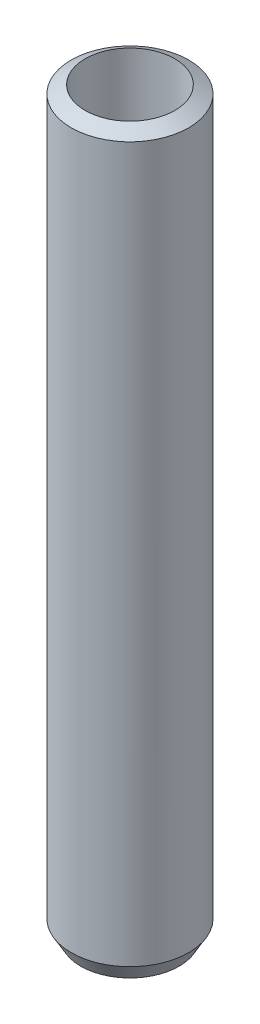
ISO-10303-21;
HEADER;
FILE_DESCRIPTION(('STEP AP214'),'2;1');
FILE_NAME('part.step','',(''),(''),'','','');
FILE_SCHEMA(('AUTOMOTIVE_DESIGN { 1 0 10303 214 1 1 1 1 }'));
ENDSEC;
DATA;
#1=APPLICATION_CONTEXT('core data for automotive mechanical design processes');
#2=APPLICATION_PROTOCOL_DEFINITION('international standard','automotive_design',2000,#1);
#3=PRODUCT_CONTEXT('',#1,'mechanical');
#4=PRODUCT('Part','Part','',(#3));
#5=PRODUCT_RELATED_PRODUCT_CATEGORY('part','',(#4));
#6=PRODUCT_DEFINITION_FORMATION('','',#4);
#7=PRODUCT_DEFINITION_CONTEXT('part definition',#1,'design');
#8=PRODUCT_DEFINITION('design','',#6,#7);
#9=PRODUCT_DEFINITION_SHAPE('','',#8);
#10=(LENGTH_UNIT() NAMED_UNIT(*) SI_UNIT(.MILLI.,.METRE.));
#11=(NAMED_UNIT(*) PLANE_ANGLE_UNIT() SI_UNIT($,.RADIAN.));
#12=(NAMED_UNIT(*) SI_UNIT($,.STERADIAN.) SOLID_ANGLE_UNIT());
#13=UNCERTAINTY_MEASURE_WITH_UNIT(LENGTH_MEASURE(1.E-05),#10,'distance_accuracy_value','');
#14=(GEOMETRIC_REPRESENTATION_CONTEXT(3) GLOBAL_UNCERTAINTY_ASSIGNED_CONTEXT((#13)) GLOBAL_UNIT_ASSIGNED_CONTEXT((#10,
#11,#12)) REPRESENTATION_CONTEXT('',''));
#15=CARTESIAN_POINT('',(0.,0.,0.));
#16=DIRECTION('',(0.,0.,1.));
#17=DIRECTION('',(1.,0.,0.));
#18=AXIS2_PLACEMENT_3D('',#15,#16,#17);
#19=CARTESIAN_POINT('',(0.,315.095017230182,0.));
#20=DIRECTION('',(0.,-1.,0.));
#21=DIRECTION('',(0.,0.,-1.));
#22=AXIS2_PLACEMENT_3D('',#19,#20,#21);
#23=CYLINDRICAL_SURFACE('',#22,25.);
#24=CARTESIAN_POINT('',(0.,311.028406974981,0.));
#25=DIRECTION('',(0.,1.,0.));
#26=DIRECTION('',(0.,0.,1.));
#27=AXIS2_PLACEMENT_3D('',#24,#25,#26);
#28=CIRCLE('',#27,25.);
#29=CARTESIAN_POINT('',(0.,311.028406974981,25.));
#30=VERTEX_POINT('',#29);
#31=EDGE_CURVE('E50',#30,#30,#28,.F.);
#32=ORIENTED_EDGE('',*,*,#31,.T.);
#33=EDGE_LOOP('',(#32));
#34=FACE_BOUND('',#33,.T.);
#35=CARTESIAN_POINT('',(0.,7.04357557658775,0.));
#36=DIRECTION('',(0.,1.,0.));
#37=DIRECTION('',(0.,0.,1.));
#38=AXIS2_PLACEMENT_3D('',#35,#36,#37);
#39=CIRCLE('',#38,25.);
#40=CARTESIAN_POINT('',(0.,7.04357557658775,25.));
#41=VERTEX_POINT('',#40);
#42=EDGE_CURVE('E51',#41,#41,#39,.T.);
#43=ORIENTED_EDGE('',*,*,#42,.T.);
#44=EDGE_LOOP('',(#43));
#45=FACE_BOUND('',#44,.T.);
#46=ADVANCED_FACE('F39',(#34,#45),#23,.T.);
#47=CARTESIAN_POINT('',(0.,0.,0.));
#48=DIRECTION('',(0.,1.,0.));
#49=DIRECTION('',(0.,0.,1.));
#50=AXIS2_PLACEMENT_3D('',#47,#48,#49);
#51=PLANE('',#50);
#52=CARTESIAN_POINT('',(0.,0.,0.));
#53=DIRECTION('',(0.,1.,0.));
#54=DIRECTION('',(0.,0.,1.));
#55=AXIS2_PLACEMENT_3D('',#52,#53,#54);
#56=CIRCLE('',#55,20.9333897447996);
#57=CARTESIAN_POINT('',(0.,0.,20.9333897447996));
#58=VERTEX_POINT('',#57);
#59=EDGE_CURVE('E10',#58,#58,#56,.F.);
#60=ORIENTED_EDGE('',*,*,#59,.T.);
#61=EDGE_LOOP('',(#60));
#62=FACE_BOUND('',#61,.T.);
#63=CARTESIAN_POINT('',(0.,0.,0.));
#64=DIRECTION('',(0.,1.,0.));
#65=DIRECTION('',(0.,0.,1.));
#66=AXIS2_PLACEMENT_3D('',#63,#64,#65);
#67=CIRCLE('',#66,19.0792704840567);
#68=CARTESIAN_POINT('',(0.,0.,19.0792704840567));
#69=VERTEX_POINT('',#68);
#70=EDGE_CURVE('E58',#69,#69,#67,.T.);
#71=ORIENTED_EDGE('',*,*,#70,.T.);
#72=EDGE_LOOP('',(#71));
#73=FACE_BOUND('',#72,.T.);
#74=ADVANCED_FACE('F62',(#62,#73),#51,.F.);
#75=CARTESIAN_POINT('',(0.,315.095017230182,0.));
#76=DIRECTION('',(0.,-1.,0.));
#77=DIRECTION('',(0.,0.,-1.));
#78=AXIS2_PLACEMENT_3D('',#75,#76,#77);
#79=CYLINDRICAL_SURFACE('',#78,19.0792704840567);
#80=CARTESIAN_POINT('',(0.,314.44674175481,0.));
#81=DIRECTION('',(0.,-1.,0.));
#82=DIRECTION('',(0.,0.,-1.));
#83=AXIS2_PLACEMENT_3D('',#80,#81,#82);
#84=CIRCLE('',#83,19.0792704840567);
#85=CARTESIAN_POINT('',(0.,314.44674175481,-19.0792704840567));
#86=VERTEX_POINT('',#85);
#87=EDGE_CURVE('E54',#86,#86,#84,.F.);
#88=ORIENTED_EDGE('',*,*,#87,.T.);
#89=EDGE_LOOP('',(#88));
#90=FACE_BOUND('',#89,.T.);
#91=ORIENTED_EDGE('',*,*,#70,.F.);
#92=EDGE_LOOP('',(#91));
#93=FACE_BOUND('',#92,.T.);
#94=ADVANCED_FACE('F68',(#90,#93),#79,.F.);
#95=CARTESIAN_POINT('',(0.,315.095017230182,0.));
#96=DIRECTION('',(0.,-1.,0.));
#97=DIRECTION('',(0.,0.,-1.));
#98=AXIS2_PLACEMENT_3D('',#95,#96,#97);
#99=CONICAL_SURFACE('',#98,17.9564244234119,1.0471975511966);
#100=ORIENTED_EDGE('',*,*,#31,.F.);
#101=EDGE_LOOP('',(#100));
#102=FACE_BOUND('',#101,.T.);
#103=ORIENTED_EDGE('',*,*,#87,.F.);
#104=EDGE_LOOP('',(#103));
#105=FACE_BOUND('',#104,.T.);
#106=ADVANCED_FACE('F66',(#102,#105),#99,.T.);
#107=CARTESIAN_POINT('',(0.,7.04357557658775,0.));
#108=DIRECTION('',(0.,1.,0.));
#109=DIRECTION('',(0.,0.,1.));
#110=AXIS2_PLACEMENT_3D('',#107,#108,#109);
#111=CONICAL_SURFACE('',#110,25.,0.523598775598303);
#112=ORIENTED_EDGE('',*,*,#59,.F.);
#113=EDGE_LOOP('',(#112));
#114=FACE_BOUND('',#113,.T.);
#115=ORIENTED_EDGE('',*,*,#42,.F.);
#116=EDGE_LOOP('',(#115));
#117=FACE_BOUND('',#116,.T.);
#118=ADVANCED_FACE('F45',(#114,#117),#111,.T.);
#119=CLOSED_SHELL('',(#46,#74,#94,#106,#118));
#120=MANIFOLD_SOLID_BREP('B2',#119);
#121=ADVANCED_BREP_SHAPE_REPRESENTATION('',(#18,#120),#14);
#122=SHAPE_DEFINITION_REPRESENTATION(#9,#121);
ENDSEC;
END-ISO-10303-21;
